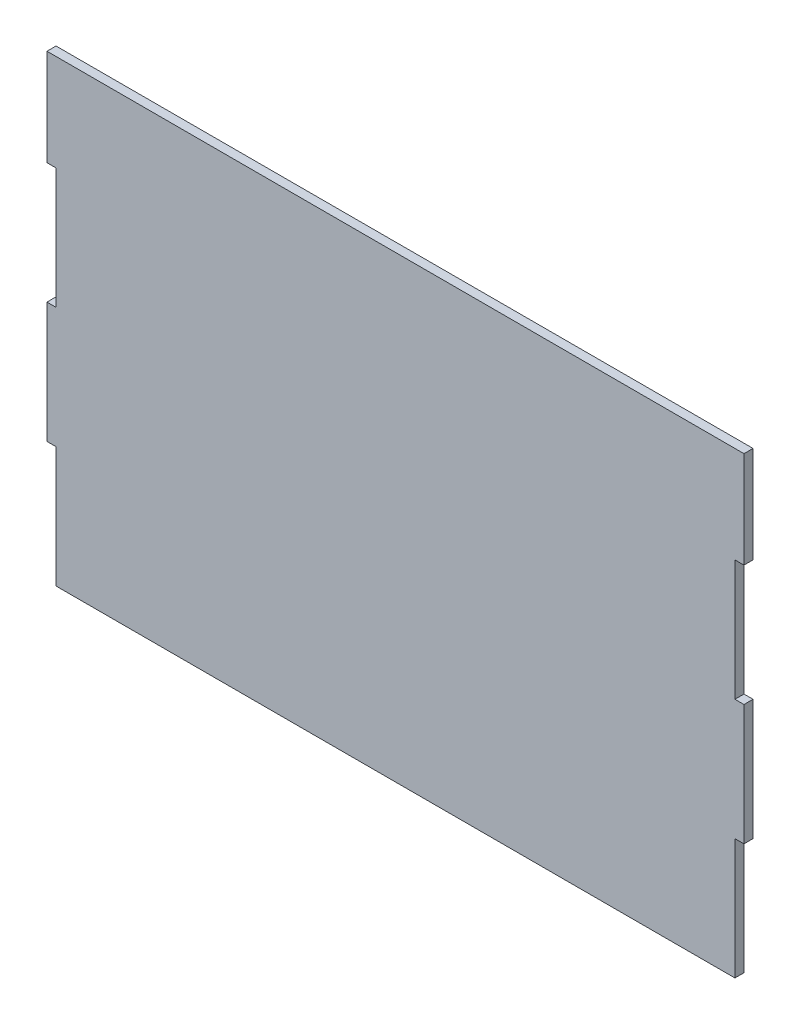
ISO-10303-21;
HEADER;
FILE_DESCRIPTION(('STEP AP214'),'2;1');
FILE_NAME('part.step','',(''),(''),'','','');
FILE_SCHEMA(('AUTOMOTIVE_DESIGN { 1 0 10303 214 1 1 1 1 }'));
ENDSEC;
DATA;
#1=APPLICATION_CONTEXT('core data for automotive mechanical design processes');
#2=APPLICATION_PROTOCOL_DEFINITION('international standard','automotive_design',2000,#1);
#3=PRODUCT_CONTEXT('',#1,'mechanical');
#4=PRODUCT('Part','Part','',(#3));
#5=PRODUCT_RELATED_PRODUCT_CATEGORY('part','',(#4));
#6=PRODUCT_DEFINITION_FORMATION('','',#4);
#7=PRODUCT_DEFINITION_CONTEXT('part definition',#1,'design');
#8=PRODUCT_DEFINITION('design','',#6,#7);
#9=PRODUCT_DEFINITION_SHAPE('','',#8);
#10=(LENGTH_UNIT() NAMED_UNIT(*) SI_UNIT(.MILLI.,.METRE.));
#11=(NAMED_UNIT(*) PLANE_ANGLE_UNIT() SI_UNIT($,.RADIAN.));
#12=(NAMED_UNIT(*) SI_UNIT($,.STERADIAN.) SOLID_ANGLE_UNIT());
#13=UNCERTAINTY_MEASURE_WITH_UNIT(LENGTH_MEASURE(1.E-05),#10,'distance_accuracy_value','');
#14=(GEOMETRIC_REPRESENTATION_CONTEXT(3) GLOBAL_UNCERTAINTY_ASSIGNED_CONTEXT((#13)) GLOBAL_UNIT_ASSIGNED_CONTEXT((#10,
#11,#12)) REPRESENTATION_CONTEXT('',''));
#15=CARTESIAN_POINT('',(0.,0.,0.));
#16=DIRECTION('',(0.,0.,1.));
#17=DIRECTION('',(1.,0.,0.));
#18=AXIS2_PLACEMENT_3D('',#15,#16,#17);
#19=CARTESIAN_POINT('',(112.5,-20.,3.));
#20=DIRECTION('',(-1.,0.,0.));
#21=DIRECTION('',(0.,0.,1.));
#22=AXIS2_PLACEMENT_3D('',#19,#20,#21);
#23=PLANE('',#22);
#24=DIRECTION('',(0.,1.,0.));
#25=VECTOR('',#24,1.);
#26=CARTESIAN_POINT('',(112.5,-20.,0.));
#27=LINE('',#26,#25);
#28=CARTESIAN_POINT('',(112.5,-60.,0.));
#29=VERTEX_POINT('',#28);
#30=CARTESIAN_POINT('',(112.5,-20.,0.));
#31=VERTEX_POINT('',#30);
#32=EDGE_CURVE('E181',#29,#31,#27,.T.);
#33=ORIENTED_EDGE('',*,*,#32,.T.);
#34=DIRECTION('',(0.,0.,-1.));
#35=VECTOR('',#34,1.);
#36=CARTESIAN_POINT('',(112.5,-20.,3.));
#37=LINE('',#36,#35);
#38=CARTESIAN_POINT('',(112.5,-20.,3.));
#39=VERTEX_POINT('',#38);
#40=EDGE_CURVE('E11',#39,#31,#37,.T.);
#41=ORIENTED_EDGE('',*,*,#40,.F.);
#42=DIRECTION('',(0.,1.,0.));
#43=VECTOR('',#42,1.);
#44=CARTESIAN_POINT('',(112.5,-20.,3.));
#45=LINE('',#44,#43);
#46=CARTESIAN_POINT('',(112.5,-60.,3.));
#47=VERTEX_POINT('',#46);
#48=EDGE_CURVE('E212',#47,#39,#45,.T.);
#49=ORIENTED_EDGE('',*,*,#48,.F.);
#50=DIRECTION('',(0.,0.,-1.));
#51=VECTOR('',#50,1.);
#52=CARTESIAN_POINT('',(112.5,-60.,3.));
#53=LINE('',#52,#51);
#54=EDGE_CURVE('E177',#47,#29,#53,.T.);
#55=ORIENTED_EDGE('',*,*,#54,.T.);
#56=EDGE_LOOP('',(#33,#41,#49,#55));
#57=FACE_BOUND('',#56,.T.);
#58=ADVANCED_FACE('F37',(#57),#23,.F.);
#59=CARTESIAN_POINT('',(115.5,-20.,3.));
#60=DIRECTION('',(0.,1.,0.));
#61=DIRECTION('',(-1.,0.,0.));
#62=AXIS2_PLACEMENT_3D('',#59,#60,#61);
#63=PLANE('',#62);
#64=DIRECTION('',(1.,0.,0.));
#65=VECTOR('',#64,1.);
#66=CARTESIAN_POINT('',(115.5,-20.,0.));
#67=LINE('',#66,#65);
#68=CARTESIAN_POINT('',(115.5,-20.,0.));
#69=VERTEX_POINT('',#68);
#70=EDGE_CURVE('E184',#31,#69,#67,.T.);
#71=ORIENTED_EDGE('',*,*,#70,.T.);
#72=DIRECTION('',(0.,0.,-1.));
#73=VECTOR('',#72,1.);
#74=CARTESIAN_POINT('',(115.5,-20.,3.));
#75=LINE('',#74,#73);
#76=CARTESIAN_POINT('',(115.5,-20.,3.));
#77=VERTEX_POINT('',#76);
#78=EDGE_CURVE('E45',#77,#69,#75,.T.);
#79=ORIENTED_EDGE('',*,*,#78,.F.);
#80=DIRECTION('',(1.,0.,0.));
#81=VECTOR('',#80,1.);
#82=CARTESIAN_POINT('',(115.5,-20.,3.));
#83=LINE('',#82,#81);
#84=EDGE_CURVE('E120',#39,#77,#83,.T.);
#85=ORIENTED_EDGE('',*,*,#84,.F.);
#86=ORIENTED_EDGE('',*,*,#40,.T.);
#87=EDGE_LOOP('',(#71,#79,#85,#86));
#88=FACE_BOUND('',#87,.T.);
#89=ADVANCED_FACE('F310',(#88),#63,.F.);
#90=CARTESIAN_POINT('',(115.5,20.,3.));
#91=DIRECTION('',(-1.,0.,0.));
#92=DIRECTION('',(0.,0.,1.));
#93=AXIS2_PLACEMENT_3D('',#90,#91,#92);
#94=PLANE('',#93);
#95=DIRECTION('',(0.,1.,0.));
#96=VECTOR('',#95,1.);
#97=CARTESIAN_POINT('',(115.5,20.,0.));
#98=LINE('',#97,#96);
#99=CARTESIAN_POINT('',(115.5,20.,0.));
#100=VERTEX_POINT('',#99);
#101=EDGE_CURVE('E186',#69,#100,#98,.T.);
#102=ORIENTED_EDGE('',*,*,#101,.T.);
#103=DIRECTION('',(0.,0.,-1.));
#104=VECTOR('',#103,1.);
#105=CARTESIAN_POINT('',(115.5,20.,3.));
#106=LINE('',#105,#104);
#107=CARTESIAN_POINT('',(115.5,20.,3.));
#108=VERTEX_POINT('',#107);
#109=EDGE_CURVE('E243',#108,#100,#106,.T.);
#110=ORIENTED_EDGE('',*,*,#109,.F.);
#111=DIRECTION('',(0.,1.,0.));
#112=VECTOR('',#111,1.);
#113=CARTESIAN_POINT('',(115.5,20.,3.));
#114=LINE('',#113,#112);
#115=EDGE_CURVE('E251',#77,#108,#114,.T.);
#116=ORIENTED_EDGE('',*,*,#115,.F.);
#117=ORIENTED_EDGE('',*,*,#78,.T.);
#118=EDGE_LOOP('',(#102,#110,#116,#117));
#119=FACE_BOUND('',#118,.T.);
#120=ADVANCED_FACE('F249',(#119),#94,.F.);
#121=CARTESIAN_POINT('',(112.5,20.,3.));
#122=DIRECTION('',(0.,-1.,0.));
#123=DIRECTION('',(1.,0.,0.));
#124=AXIS2_PLACEMENT_3D('',#121,#122,#123);
#125=PLANE('',#124);
#126=DIRECTION('',(-1.,0.,0.));
#127=VECTOR('',#126,1.);
#128=CARTESIAN_POINT('',(112.5,20.,0.));
#129=LINE('',#128,#127);
#130=CARTESIAN_POINT('',(112.5,20.,0.));
#131=VERTEX_POINT('',#130);
#132=EDGE_CURVE('E188',#100,#131,#129,.T.);
#133=ORIENTED_EDGE('',*,*,#132,.T.);
#134=DIRECTION('',(0.,0.,-1.));
#135=VECTOR('',#134,1.);
#136=CARTESIAN_POINT('',(112.5,20.,3.));
#137=LINE('',#136,#135);
#138=CARTESIAN_POINT('',(112.5,20.,3.));
#139=VERTEX_POINT('',#138);
#140=EDGE_CURVE('E240',#139,#131,#137,.T.);
#141=ORIENTED_EDGE('',*,*,#140,.F.);
#142=DIRECTION('',(-1.,0.,0.));
#143=VECTOR('',#142,1.);
#144=CARTESIAN_POINT('',(112.5,20.,3.));
#145=LINE('',#144,#143);
#146=EDGE_CURVE('E269',#108,#139,#145,.T.);
#147=ORIENTED_EDGE('',*,*,#146,.F.);
#148=ORIENTED_EDGE('',*,*,#109,.T.);
#149=EDGE_LOOP('',(#133,#141,#147,#148));
#150=FACE_BOUND('',#149,.T.);
#151=ADVANCED_FACE('F260',(#150),#125,.F.);
#152=CARTESIAN_POINT('',(112.5,60.,3.));
#153=DIRECTION('',(-1.,0.,0.));
#154=DIRECTION('',(0.,0.,1.));
#155=AXIS2_PLACEMENT_3D('',#152,#153,#154);
#156=PLANE('',#155);
#157=DIRECTION('',(0.,1.,0.));
#158=VECTOR('',#157,1.);
#159=CARTESIAN_POINT('',(112.5,60.,0.));
#160=LINE('',#159,#158);
#161=CARTESIAN_POINT('',(112.5,60.,0.));
#162=VERTEX_POINT('',#161);
#163=EDGE_CURVE('E190',#131,#162,#160,.T.);
#164=ORIENTED_EDGE('',*,*,#163,.T.);
#165=DIRECTION('',(0.,0.,-1.));
#166=VECTOR('',#165,1.);
#167=CARTESIAN_POINT('',(112.5,60.,3.));
#168=LINE('',#167,#166);
#169=CARTESIAN_POINT('',(112.5,60.,3.));
#170=VERTEX_POINT('',#169);
#171=EDGE_CURVE('E237',#170,#162,#168,.T.);
#172=ORIENTED_EDGE('',*,*,#171,.F.);
#173=DIRECTION('',(0.,1.,0.));
#174=VECTOR('',#173,1.);
#175=CARTESIAN_POINT('',(112.5,60.,3.));
#176=LINE('',#175,#174);
#177=EDGE_CURVE('E266',#139,#170,#176,.T.);
#178=ORIENTED_EDGE('',*,*,#177,.F.);
#179=ORIENTED_EDGE('',*,*,#140,.T.);
#180=EDGE_LOOP('',(#164,#172,#178,#179));
#181=FACE_BOUND('',#180,.T.);
#182=ADVANCED_FACE('F264',(#181),#156,.F.);
#183=CARTESIAN_POINT('',(115.5,60.,3.));
#184=DIRECTION('',(0.,1.,0.));
#185=DIRECTION('',(0.,0.,1.));
#186=AXIS2_PLACEMENT_3D('',#183,#184,#185);
#187=PLANE('',#186);
#188=DIRECTION('',(1.,0.,0.));
#189=VECTOR('',#188,1.);
#190=CARTESIAN_POINT('',(115.5,60.,0.));
#191=LINE('',#190,#189);
#192=CARTESIAN_POINT('',(115.5,60.,0.));
#193=VERTEX_POINT('',#192);
#194=EDGE_CURVE('E192',#162,#193,#191,.T.);
#195=ORIENTED_EDGE('',*,*,#194,.T.);
#196=DIRECTION('',(0.,0.,-1.));
#197=VECTOR('',#196,1.);
#198=CARTESIAN_POINT('',(115.5,60.,3.));
#199=LINE('',#198,#197);
#200=CARTESIAN_POINT('',(115.5,60.,3.));
#201=VERTEX_POINT('',#200);
#202=EDGE_CURVE('E234',#201,#193,#199,.T.);
#203=ORIENTED_EDGE('',*,*,#202,.F.);
#204=DIRECTION('',(1.,0.,0.));
#205=VECTOR('',#204,1.);
#206=CARTESIAN_POINT('',(115.5,60.,3.));
#207=LINE('',#206,#205);
#208=EDGE_CURVE('E268',#170,#201,#207,.T.);
#209=ORIENTED_EDGE('',*,*,#208,.F.);
#210=ORIENTED_EDGE('',*,*,#171,.T.);
#211=EDGE_LOOP('',(#195,#203,#209,#210));
#212=FACE_BOUND('',#211,.T.);
#213=ADVANCED_FACE('F323',(#212),#187,.F.);
#214=CARTESIAN_POINT('',(115.5,92.,3.));
#215=DIRECTION('',(-1.,0.,0.));
#216=DIRECTION('',(0.,0.,1.));
#217=AXIS2_PLACEMENT_3D('',#214,#215,#216);
#218=PLANE('',#217);
#219=DIRECTION('',(0.,1.,0.));
#220=VECTOR('',#219,1.);
#221=CARTESIAN_POINT('',(115.5,92.,0.));
#222=LINE('',#221,#220);
#223=CARTESIAN_POINT('',(115.5,92.,0.));
#224=VERTEX_POINT('',#223);
#225=EDGE_CURVE('E194',#193,#224,#222,.T.);
#226=ORIENTED_EDGE('',*,*,#225,.T.);
#227=DIRECTION('',(0.,0.,-1.));
#228=VECTOR('',#227,1.);
#229=CARTESIAN_POINT('',(115.5,92.,3.));
#230=LINE('',#229,#228);
#231=CARTESIAN_POINT('',(115.5,92.,3.));
#232=VERTEX_POINT('',#231);
#233=EDGE_CURVE('E231',#232,#224,#230,.T.);
#234=ORIENTED_EDGE('',*,*,#233,.F.);
#235=DIRECTION('',(0.,1.,0.));
#236=VECTOR('',#235,1.);
#237=CARTESIAN_POINT('',(115.5,92.,3.));
#238=LINE('',#237,#236);
#239=EDGE_CURVE('E271',#201,#232,#238,.T.);
#240=ORIENTED_EDGE('',*,*,#239,.F.);
#241=ORIENTED_EDGE('',*,*,#202,.T.);
#242=EDGE_LOOP('',(#226,#234,#240,#241));
#243=FACE_BOUND('',#242,.T.);
#244=ADVANCED_FACE('F326',(#243),#218,.F.);
#245=CARTESIAN_POINT('',(-115.5,92.,3.));
#246=DIRECTION('',(0.,-1.,0.));
#247=DIRECTION('',(0.,0.,-1.));
#248=AXIS2_PLACEMENT_3D('',#245,#246,#247);
#249=PLANE('',#248);
#250=DIRECTION('',(-1.,0.,0.));
#251=VECTOR('',#250,1.);
#252=CARTESIAN_POINT('',(-115.5,92.,0.));
#253=LINE('',#252,#251);
#254=CARTESIAN_POINT('',(-115.5,92.,0.));
#255=VERTEX_POINT('',#254);
#256=EDGE_CURVE('E197',#224,#255,#253,.T.);
#257=ORIENTED_EDGE('',*,*,#256,.T.);
#258=DIRECTION('',(0.,0.,-1.));
#259=VECTOR('',#258,1.);
#260=CARTESIAN_POINT('',(-115.5,92.,3.));
#261=LINE('',#260,#259);
#262=CARTESIAN_POINT('',(-115.5,92.,3.));
#263=VERTEX_POINT('',#262);
#264=EDGE_CURVE('E228',#263,#255,#261,.T.);
#265=ORIENTED_EDGE('',*,*,#264,.F.);
#266=DIRECTION('',(-1.,0.,0.));
#267=VECTOR('',#266,1.);
#268=CARTESIAN_POINT('',(112.5,92.,3.));
#269=LINE('',#268,#267);
#270=EDGE_CURVE('E277',#232,#263,#269,.T.);
#271=ORIENTED_EDGE('',*,*,#270,.F.);
#272=ORIENTED_EDGE('',*,*,#233,.T.);
#273=EDGE_LOOP('',(#257,#265,#271,#272));
#274=FACE_BOUND('',#273,.T.);
#275=ADVANCED_FACE('F330',(#274),#249,.F.);
#276=CARTESIAN_POINT('',(-115.5,60.,3.));
#277=DIRECTION('',(1.,0.,0.));
#278=DIRECTION('',(0.,0.,-1.));
#279=AXIS2_PLACEMENT_3D('',#276,#277,#278);
#280=PLANE('',#279);
#281=DIRECTION('',(0.,-1.,0.));
#282=VECTOR('',#281,1.);
#283=CARTESIAN_POINT('',(-115.5,60.,0.));
#284=LINE('',#283,#282);
#285=CARTESIAN_POINT('',(-115.5,60.,0.));
#286=VERTEX_POINT('',#285);
#287=EDGE_CURVE('E199',#255,#286,#284,.T.);
#288=ORIENTED_EDGE('',*,*,#287,.T.);
#289=DIRECTION('',(0.,0.,-1.));
#290=VECTOR('',#289,1.);
#291=CARTESIAN_POINT('',(-115.5,60.,3.));
#292=LINE('',#291,#290);
#293=CARTESIAN_POINT('',(-115.5,60.,3.));
#294=VERTEX_POINT('',#293);
#295=EDGE_CURVE('E225',#294,#286,#292,.T.);
#296=ORIENTED_EDGE('',*,*,#295,.F.);
#297=DIRECTION('',(0.,-1.,0.));
#298=VECTOR('',#297,1.);
#299=CARTESIAN_POINT('',(-115.5,60.,3.));
#300=LINE('',#299,#298);
#301=EDGE_CURVE('E279',#263,#294,#300,.T.);
#302=ORIENTED_EDGE('',*,*,#301,.F.);
#303=ORIENTED_EDGE('',*,*,#264,.T.);
#304=EDGE_LOOP('',(#288,#296,#302,#303));
#305=FACE_BOUND('',#304,.T.);
#306=ADVANCED_FACE('F334',(#305),#280,.F.);
#307=CARTESIAN_POINT('',(-112.5,60.,3.));
#308=DIRECTION('',(0.,1.,0.));
#309=DIRECTION('',(0.,0.,1.));
#310=AXIS2_PLACEMENT_3D('',#307,#308,#309);
#311=PLANE('',#310);
#312=DIRECTION('',(1.,0.,0.));
#313=VECTOR('',#312,1.);
#314=CARTESIAN_POINT('',(-112.5,60.,0.));
#315=LINE('',#314,#313);
#316=CARTESIAN_POINT('',(-112.5,60.,0.));
#317=VERTEX_POINT('',#316);
#318=EDGE_CURVE('E201',#286,#317,#315,.T.);
#319=ORIENTED_EDGE('',*,*,#318,.T.);
#320=DIRECTION('',(0.,0.,-1.));
#321=VECTOR('',#320,1.);
#322=CARTESIAN_POINT('',(-112.5,60.,3.));
#323=LINE('',#322,#321);
#324=CARTESIAN_POINT('',(-112.5,60.,3.));
#325=VERTEX_POINT('',#324);
#326=EDGE_CURVE('E222',#325,#317,#323,.T.);
#327=ORIENTED_EDGE('',*,*,#326,.F.);
#328=DIRECTION('',(1.,0.,0.));
#329=VECTOR('',#328,1.);
#330=CARTESIAN_POINT('',(-112.5,60.,3.));
#331=LINE('',#330,#329);
#332=EDGE_CURVE('E281',#294,#325,#331,.T.);
#333=ORIENTED_EDGE('',*,*,#332,.F.);
#334=ORIENTED_EDGE('',*,*,#295,.T.);
#335=EDGE_LOOP('',(#319,#327,#333,#334));
#336=FACE_BOUND('',#335,.T.);
#337=ADVANCED_FACE('F338',(#336),#311,.F.);
#338=CARTESIAN_POINT('',(-112.5,60.,3.));
#339=DIRECTION('',(1.,0.,0.));
#340=DIRECTION('',(0.,0.,-1.));
#341=AXIS2_PLACEMENT_3D('',#338,#339,#340);
#342=PLANE('',#341);
#343=DIRECTION('',(0.,-1.,0.));
#344=VECTOR('',#343,1.);
#345=CARTESIAN_POINT('',(-112.5,60.,0.));
#346=LINE('',#345,#344);
#347=CARTESIAN_POINT('',(-112.5,20.,0.));
#348=VERTEX_POINT('',#347);
#349=EDGE_CURVE('E203',#317,#348,#346,.T.);
#350=ORIENTED_EDGE('',*,*,#349,.T.);
#351=DIRECTION('',(0.,0.,-1.));
#352=VECTOR('',#351,1.);
#353=CARTESIAN_POINT('',(-112.5,20.,3.));
#354=LINE('',#353,#352);
#355=CARTESIAN_POINT('',(-112.5,20.,3.));
#356=VERTEX_POINT('',#355);
#357=EDGE_CURVE('E219',#356,#348,#354,.T.);
#358=ORIENTED_EDGE('',*,*,#357,.F.);
#359=DIRECTION('',(0.,-1.,0.));
#360=VECTOR('',#359,1.);
#361=CARTESIAN_POINT('',(-112.5,60.,3.));
#362=LINE('',#361,#360);
#363=EDGE_CURVE('E283',#325,#356,#362,.T.);
#364=ORIENTED_EDGE('',*,*,#363,.F.);
#365=ORIENTED_EDGE('',*,*,#326,.T.);
#366=EDGE_LOOP('',(#350,#358,#364,#365));
#367=FACE_BOUND('',#366,.T.);
#368=ADVANCED_FACE('F342',(#367),#342,.F.);
#369=CARTESIAN_POINT('',(-112.5,20.,3.));
#370=DIRECTION('',(0.,-1.,0.));
#371=DIRECTION('',(0.,0.,-1.));
#372=AXIS2_PLACEMENT_3D('',#369,#370,#371);
#373=PLANE('',#372);
#374=DIRECTION('',(-1.,0.,0.));
#375=VECTOR('',#374,1.);
#376=CARTESIAN_POINT('',(-112.5,20.,0.));
#377=LINE('',#376,#375);
#378=CARTESIAN_POINT('',(-115.5,20.,0.));
#379=VERTEX_POINT('',#378);
#380=EDGE_CURVE('E205',#348,#379,#377,.T.);
#381=ORIENTED_EDGE('',*,*,#380,.T.);
#382=DIRECTION('',(0.,0.,-1.));
#383=VECTOR('',#382,1.);
#384=CARTESIAN_POINT('',(-115.5,20.,3.));
#385=LINE('',#384,#383);
#386=CARTESIAN_POINT('',(-115.5,20.,3.));
#387=VERTEX_POINT('',#386);
#388=EDGE_CURVE('E216',#387,#379,#385,.T.);
#389=ORIENTED_EDGE('',*,*,#388,.F.);
#390=DIRECTION('',(-1.,0.,0.));
#391=VECTOR('',#390,1.);
#392=CARTESIAN_POINT('',(-112.5,20.,3.));
#393=LINE('',#392,#391);
#394=EDGE_CURVE('E285',#356,#387,#393,.T.);
#395=ORIENTED_EDGE('',*,*,#394,.F.);
#396=ORIENTED_EDGE('',*,*,#357,.T.);
#397=EDGE_LOOP('',(#381,#389,#395,#396));
#398=FACE_BOUND('',#397,.T.);
#399=ADVANCED_FACE('F291',(#398),#373,.F.);
#400=CARTESIAN_POINT('',(-115.5,20.,3.));
#401=DIRECTION('',(1.,0.,0.));
#402=DIRECTION('',(0.,0.,-1.));
#403=AXIS2_PLACEMENT_3D('',#400,#401,#402);
#404=PLANE('',#403);
#405=DIRECTION('',(0.,-1.,0.));
#406=VECTOR('',#405,1.);
#407=CARTESIAN_POINT('',(-115.5,20.,0.));
#408=LINE('',#407,#406);
#409=CARTESIAN_POINT('',(-115.5,-20.,0.));
#410=VERTEX_POINT('',#409);
#411=EDGE_CURVE('E207',#379,#410,#408,.T.);
#412=ORIENTED_EDGE('',*,*,#411,.T.);
#413=DIRECTION('',(0.,0.,-1.));
#414=VECTOR('',#413,1.);
#415=CARTESIAN_POINT('',(-115.5,-20.,3.));
#416=LINE('',#415,#414);
#417=CARTESIAN_POINT('',(-115.5,-20.,3.));
#418=VERTEX_POINT('',#417);
#419=EDGE_CURVE('E172',#418,#410,#416,.T.);
#420=ORIENTED_EDGE('',*,*,#419,.F.);
#421=DIRECTION('',(0.,-1.,0.));
#422=VECTOR('',#421,1.);
#423=CARTESIAN_POINT('',(-115.5,20.,3.));
#424=LINE('',#423,#422);
#425=EDGE_CURVE('E163',#387,#418,#424,.T.);
#426=ORIENTED_EDGE('',*,*,#425,.F.);
#427=ORIENTED_EDGE('',*,*,#388,.T.);
#428=EDGE_LOOP('',(#412,#420,#426,#427));
#429=FACE_BOUND('',#428,.T.);
#430=ADVANCED_FACE('F295',(#429),#404,.F.);
#431=CARTESIAN_POINT('',(-115.5,-20.,3.));
#432=DIRECTION('',(0.,1.,0.));
#433=DIRECTION('',(0.,0.,1.));
#434=AXIS2_PLACEMENT_3D('',#431,#432,#433);
#435=PLANE('',#434);
#436=DIRECTION('',(1.,0.,0.));
#437=VECTOR('',#436,1.);
#438=CARTESIAN_POINT('',(-115.5,-20.,0.));
#439=LINE('',#438,#437);
#440=CARTESIAN_POINT('',(-112.5,-20.,0.));
#441=VERTEX_POINT('',#440);
#442=EDGE_CURVE('E171',#410,#441,#439,.T.);
#443=ORIENTED_EDGE('',*,*,#442,.T.);
#444=DIRECTION('',(0.,0.,-1.));
#445=VECTOR('',#444,1.);
#446=CARTESIAN_POINT('',(-112.5,-20.,3.));
#447=LINE('',#446,#445);
#448=CARTESIAN_POINT('',(-112.5,-20.,3.));
#449=VERTEX_POINT('',#448);
#450=EDGE_CURVE('E168',#449,#441,#447,.T.);
#451=ORIENTED_EDGE('',*,*,#450,.F.);
#452=DIRECTION('',(1.,0.,0.));
#453=VECTOR('',#452,1.);
#454=CARTESIAN_POINT('',(-115.5,-20.,3.));
#455=LINE('',#454,#453);
#456=EDGE_CURVE('E157',#418,#449,#455,.T.);
#457=ORIENTED_EDGE('',*,*,#456,.F.);
#458=ORIENTED_EDGE('',*,*,#419,.T.);
#459=EDGE_LOOP('',(#443,#451,#457,#458));
#460=FACE_BOUND('',#459,.T.);
#461=ADVANCED_FACE('F169',(#460),#435,.F.);
#462=CARTESIAN_POINT('',(-112.5,-20.,3.));
#463=DIRECTION('',(1.,0.,0.));
#464=DIRECTION('',(0.,1.,0.));
#465=AXIS2_PLACEMENT_3D('',#462,#463,#464);
#466=PLANE('',#465);
#467=DIRECTION('',(0.,-1.,0.));
#468=VECTOR('',#467,1.);
#469=CARTESIAN_POINT('',(-112.5,-20.,0.));
#470=LINE('',#469,#468);
#471=CARTESIAN_POINT('',(-112.5,-60.,0.));
#472=VERTEX_POINT('',#471);
#473=EDGE_CURVE('E106',#441,#472,#470,.T.);
#474=ORIENTED_EDGE('',*,*,#473,.T.);
#475=DIRECTION('',(0.,0.,-1.));
#476=VECTOR('',#475,1.);
#477=CARTESIAN_POINT('',(-112.5,-60.,3.));
#478=LINE('',#477,#476);
#479=CARTESIAN_POINT('',(-112.5,-60.,3.));
#480=VERTEX_POINT('',#479);
#481=EDGE_CURVE('E173',#480,#472,#478,.T.);
#482=ORIENTED_EDGE('',*,*,#481,.F.);
#483=DIRECTION('',(0.,-1.,0.));
#484=VECTOR('',#483,1.);
#485=CARTESIAN_POINT('',(-112.5,-20.,3.));
#486=LINE('',#485,#484);
#487=EDGE_CURVE('E161',#449,#480,#486,.T.);
#488=ORIENTED_EDGE('',*,*,#487,.F.);
#489=ORIENTED_EDGE('',*,*,#450,.T.);
#490=EDGE_LOOP('',(#474,#482,#488,#489));
#491=FACE_BOUND('',#490,.T.);
#492=ADVANCED_FACE('F175',(#491),#466,.F.);
#493=CARTESIAN_POINT('',(-112.5,-60.,3.));
#494=DIRECTION('',(0.,1.,0.));
#495=DIRECTION('',(0.,0.,1.));
#496=AXIS2_PLACEMENT_3D('',#493,#494,#495);
#497=PLANE('',#496);
#498=DIRECTION('',(1.,0.,0.));
#499=VECTOR('',#498,1.);
#500=CARTESIAN_POINT('',(-112.5,-60.,0.));
#501=LINE('',#500,#499);
#502=EDGE_CURVE('E112',#472,#29,#501,.T.);
#503=ORIENTED_EDGE('',*,*,#502,.T.);
#504=ORIENTED_EDGE('',*,*,#54,.F.);
#505=DIRECTION('',(1.,0.,0.));
#506=VECTOR('',#505,1.);
#507=CARTESIAN_POINT('',(-112.5,-60.,3.));
#508=LINE('',#507,#506);
#509=EDGE_CURVE('E53',#480,#47,#508,.T.);
#510=ORIENTED_EDGE('',*,*,#509,.F.);
#511=ORIENTED_EDGE('',*,*,#481,.T.);
#512=EDGE_LOOP('',(#503,#504,#510,#511));
#513=FACE_BOUND('',#512,.T.);
#514=ADVANCED_FACE('F299',(#513),#497,.F.);
#515=CARTESIAN_POINT('',(0.,0.,3.));
#516=DIRECTION('',(0.,0.,1.));
#517=DIRECTION('',(1.,0.,0.));
#518=AXIS2_PLACEMENT_3D('',#515,#516,#517);
#519=PLANE('',#518);
#520=ORIENTED_EDGE('',*,*,#48,.T.);
#521=ORIENTED_EDGE('',*,*,#84,.T.);
#522=ORIENTED_EDGE('',*,*,#115,.T.);
#523=ORIENTED_EDGE('',*,*,#146,.T.);
#524=ORIENTED_EDGE('',*,*,#177,.T.);
#525=ORIENTED_EDGE('',*,*,#208,.T.);
#526=ORIENTED_EDGE('',*,*,#239,.T.);
#527=ORIENTED_EDGE('',*,*,#270,.T.);
#528=ORIENTED_EDGE('',*,*,#301,.T.);
#529=ORIENTED_EDGE('',*,*,#332,.T.);
#530=ORIENTED_EDGE('',*,*,#363,.T.);
#531=ORIENTED_EDGE('',*,*,#394,.T.);
#532=ORIENTED_EDGE('',*,*,#425,.T.);
#533=ORIENTED_EDGE('',*,*,#456,.T.);
#534=ORIENTED_EDGE('',*,*,#487,.T.);
#535=ORIENTED_EDGE('',*,*,#509,.T.);
#536=EDGE_LOOP('',(#520,#521,#522,#523,#524,#525,#526,#527,#528,#529,#530,#531,#532,#533,#534,#535));
#537=FACE_BOUND('',#536,.T.);
#538=ADVANCED_FACE('F159',(#537),#519,.T.);
#539=CARTESIAN_POINT('',(0.,0.,0.));
#540=DIRECTION('',(0.,0.,1.));
#541=DIRECTION('',(1.,0.,0.));
#542=AXIS2_PLACEMENT_3D('',#539,#540,#541);
#543=PLANE('',#542);
#544=ORIENTED_EDGE('',*,*,#32,.F.);
#545=ORIENTED_EDGE('',*,*,#502,.F.);
#546=ORIENTED_EDGE('',*,*,#473,.F.);
#547=ORIENTED_EDGE('',*,*,#442,.F.);
#548=ORIENTED_EDGE('',*,*,#411,.F.);
#549=ORIENTED_EDGE('',*,*,#380,.F.);
#550=ORIENTED_EDGE('',*,*,#349,.F.);
#551=ORIENTED_EDGE('',*,*,#318,.F.);
#552=ORIENTED_EDGE('',*,*,#287,.F.);
#553=ORIENTED_EDGE('',*,*,#256,.F.);
#554=ORIENTED_EDGE('',*,*,#225,.F.);
#555=ORIENTED_EDGE('',*,*,#194,.F.);
#556=ORIENTED_EDGE('',*,*,#163,.F.);
#557=ORIENTED_EDGE('',*,*,#132,.F.);
#558=ORIENTED_EDGE('',*,*,#101,.F.);
#559=ORIENTED_EDGE('',*,*,#70,.F.);
#560=EDGE_LOOP('',(#544,#545,#546,#547,#548,#549,#550,#551,#552,#553,#554,#555,#556,#557,#558,#559));
#561=FACE_BOUND('',#560,.T.);
#562=ADVANCED_FACE('F255',(#561),#543,.F.);
#563=CLOSED_SHELL('',(#58,#89,#120,#151,#182,#213,#244,#275,#306,#337,#368,#399,#430,#461,#492,
#514,#538,#562));
#564=MANIFOLD_SOLID_BREP('B2',#563);
#565=ADVANCED_BREP_SHAPE_REPRESENTATION('',(#18,#564),#14);
#566=SHAPE_DEFINITION_REPRESENTATION(#9,#565);
ENDSEC;
END-ISO-10303-21;
